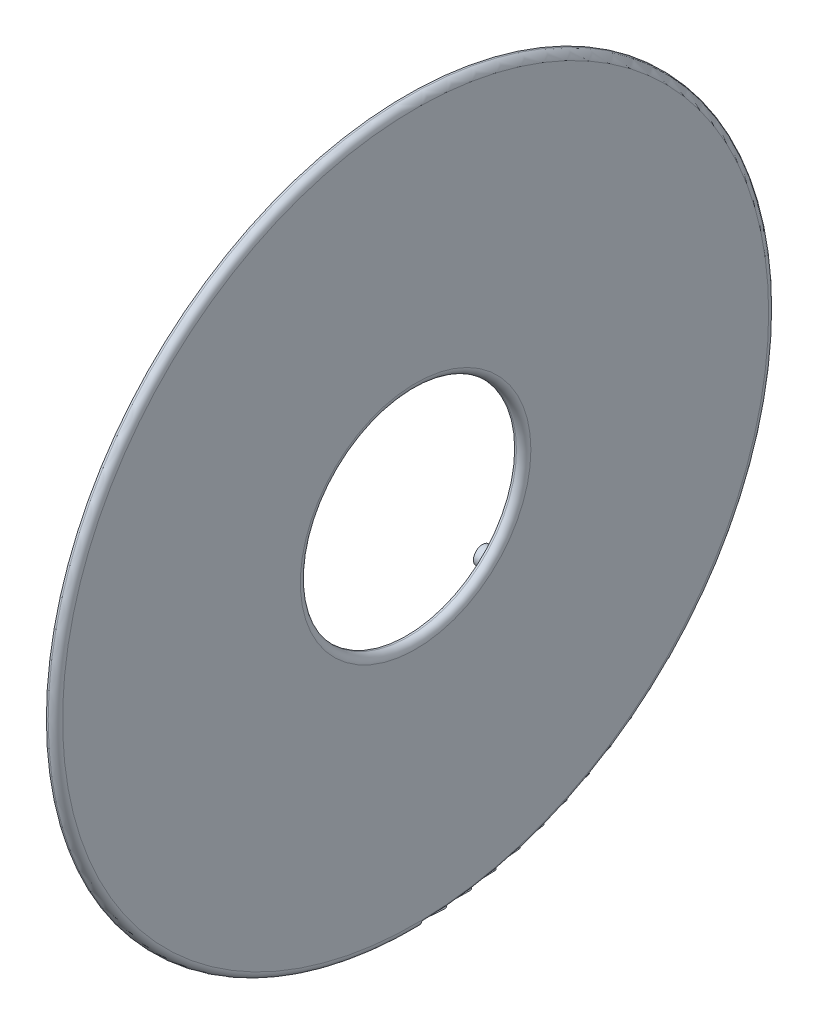
ISO-10303-21;
HEADER;
FILE_DESCRIPTION(('STEP AP214'),'2;1');
FILE_NAME('part.step','',(''),(''),'','','');
FILE_SCHEMA(('AUTOMOTIVE_DESIGN { 1 0 10303 214 1 1 1 1 }'));
ENDSEC;
DATA;
#1=APPLICATION_CONTEXT('core data for automotive mechanical design processes');
#2=APPLICATION_PROTOCOL_DEFINITION('international standard','automotive_design',2000,#1);
#3=PRODUCT_CONTEXT('',#1,'mechanical');
#4=PRODUCT('Part','Part','',(#3));
#5=PRODUCT_RELATED_PRODUCT_CATEGORY('part','',(#4));
#6=PRODUCT_DEFINITION_FORMATION('','',#4);
#7=PRODUCT_DEFINITION_CONTEXT('part definition',#1,'design');
#8=PRODUCT_DEFINITION('design','',#6,#7);
#9=PRODUCT_DEFINITION_SHAPE('','',#8);
#10=(LENGTH_UNIT() NAMED_UNIT(*) SI_UNIT(.MILLI.,.METRE.));
#11=(NAMED_UNIT(*) PLANE_ANGLE_UNIT() SI_UNIT($,.RADIAN.));
#12=(NAMED_UNIT(*) SI_UNIT($,.STERADIAN.) SOLID_ANGLE_UNIT());
#13=UNCERTAINTY_MEASURE_WITH_UNIT(LENGTH_MEASURE(1.E-05),#10,'distance_accuracy_value','');
#14=(GEOMETRIC_REPRESENTATION_CONTEXT(3) GLOBAL_UNCERTAINTY_ASSIGNED_CONTEXT((#13)) GLOBAL_UNIT_ASSIGNED_CONTEXT((#10,
#11,#12)) REPRESENTATION_CONTEXT('',''));
#15=CARTESIAN_POINT('',(0.,0.,0.));
#16=DIRECTION('',(0.,0.,1.));
#17=DIRECTION('',(1.,0.,0.));
#18=AXIS2_PLACEMENT_3D('',#15,#16,#17);
#19=CARTESIAN_POINT('',(0.,0.,0.));
#20=DIRECTION('',(1.,0.,0.));
#21=DIRECTION('',(0.,0.,-1.));
#22=AXIS2_PLACEMENT_3D('',#19,#20,#21);
#23=PLANE('',#22);
#24=CARTESIAN_POINT('',(0.,-7.63321770290865,7.63321770290874));
#25=DIRECTION('',(1.,0.,0.));
#26=DIRECTION('',(0.,0.,-1.));
#27=AXIS2_PLACEMENT_3D('',#24,#25,#26);
#28=CIRCLE('',#27,0.635000000000002);
#29=CARTESIAN_POINT('',(0.,-7.63321770290865,6.99821770290874));
#30=VERTEX_POINT('',#29);
#31=EDGE_CURVE('E39',#30,#30,#28,.F.);
#32=ORIENTED_EDGE('',*,*,#31,.F.);
#33=EDGE_LOOP('',(#32));
#34=FACE_BOUND('',#33,.T.);
#35=CARTESIAN_POINT('',(0.,7.63321770290882,-7.63321770290874));
#36=DIRECTION('',(1.,0.,0.));
#37=DIRECTION('',(0.,0.,-1.));
#38=AXIS2_PLACEMENT_3D('',#35,#36,#37);
#39=CIRCLE('',#38,0.634999999999951);
#40=CARTESIAN_POINT('',(0.,7.63321770290882,-8.26821770290869));
#41=VERTEX_POINT('',#40);
#42=EDGE_CURVE('E47',#41,#41,#39,.F.);
#43=ORIENTED_EDGE('',*,*,#42,.F.);
#44=EDGE_LOOP('',(#43));
#45=FACE_BOUND('',#44,.T.);
#46=CARTESIAN_POINT('',(0.,0.,0.));
#47=DIRECTION('',(1.,0.,0.));
#48=DIRECTION('',(0.,0.,-1.));
#49=AXIS2_PLACEMENT_3D('',#46,#47,#48);
#50=CIRCLE('',#49,25.4);
#51=CARTESIAN_POINT('',(0.,0.,-25.4));
#52=VERTEX_POINT('',#51);
#53=EDGE_CURVE('E64',#52,#52,#50,.T.);
#54=ORIENTED_EDGE('',*,*,#53,.F.);
#55=EDGE_LOOP('',(#54));
#56=FACE_BOUND('',#55,.T.);
#57=CARTESIAN_POINT('',(0.,0.,0.));
#58=DIRECTION('',(1.,0.,0.));
#59=DIRECTION('',(0.,0.,-1.));
#60=AXIS2_PLACEMENT_3D('',#57,#58,#59);
#61=CIRCLE('',#60,7.62);
#62=CARTESIAN_POINT('',(0.,0.,-7.62));
#63=VERTEX_POINT('',#62);
#64=EDGE_CURVE('E67',#63,#63,#61,.T.);
#65=ORIENTED_EDGE('',*,*,#64,.T.);
#66=EDGE_LOOP('',(#65));
#67=FACE_BOUND('',#66,.T.);
#68=CARTESIAN_POINT('',(0.,7.63321770290882,7.63321770290874));
#69=DIRECTION('',(1.,0.,0.));
#70=DIRECTION('',(0.,0.,-1.));
#71=AXIS2_PLACEMENT_3D('',#68,#69,#70);
#72=CIRCLE('',#71,0.635000000000001);
#73=CARTESIAN_POINT('',(0.,7.63321770290882,6.99821770290874));
#74=VERTEX_POINT('',#73);
#75=EDGE_CURVE('E43',#74,#74,#72,.F.);
#76=ORIENTED_EDGE('',*,*,#75,.F.);
#77=EDGE_LOOP('',(#76));
#78=FACE_BOUND('',#77,.T.);
#79=CARTESIAN_POINT('',(0.,-7.63321770290865,-7.63321770290874));
#80=DIRECTION('',(1.,0.,0.));
#81=DIRECTION('',(0.,0.,-1.));
#82=AXIS2_PLACEMENT_3D('',#79,#80,#81);
#83=CIRCLE('',#82,0.635000000000001);
#84=CARTESIAN_POINT('',(0.,-7.63321770290865,-8.26821770290874));
#85=VERTEX_POINT('',#84);
#86=EDGE_CURVE('E10',#85,#85,#83,.F.);
#87=ORIENTED_EDGE('',*,*,#86,.F.);
#88=EDGE_LOOP('',(#87));
#89=FACE_BOUND('',#88,.T.);
#90=ADVANCED_FACE('F32',(#34,#45,#56,#67,#78,#89),#23,.F.);
#91=CARTESIAN_POINT('',(0.635,0.,0.));
#92=DIRECTION('',(1.,0.,0.));
#93=DIRECTION('',(0.,0.,-1.));
#94=AXIS2_PLACEMENT_3D('',#91,#92,#93);
#95=PLANE('',#94);
#96=CARTESIAN_POINT('',(0.635,0.,0.));
#97=DIRECTION('',(1.,0.,0.));
#98=DIRECTION('',(0.,0.,-1.));
#99=AXIS2_PLACEMENT_3D('',#96,#97,#98);
#100=CIRCLE('',#99,8.128);
#101=CARTESIAN_POINT('',(0.635,0.,-8.128));
#102=VERTEX_POINT('',#101);
#103=EDGE_CURVE('E55',#102,#102,#100,.F.);
#104=ORIENTED_EDGE('',*,*,#103,.T.);
#105=EDGE_LOOP('',(#104));
#106=FACE_BOUND('',#105,.T.);
#107=CARTESIAN_POINT('',(0.635,0.,0.));
#108=DIRECTION('',(1.,0.,0.));
#109=DIRECTION('',(0.,0.,-1.));
#110=AXIS2_PLACEMENT_3D('',#107,#108,#109);
#111=CIRCLE('',#110,24.892);
#112=CARTESIAN_POINT('',(0.635,0.,-24.892));
#113=VERTEX_POINT('',#112);
#114=EDGE_CURVE('E58',#113,#113,#111,.T.);
#115=ORIENTED_EDGE('',*,*,#114,.T.);
#116=EDGE_LOOP('',(#115));
#117=FACE_BOUND('',#116,.T.);
#118=ADVANCED_FACE('F98',(#106,#117),#95,.T.);
#119=CARTESIAN_POINT('',(0.635,0.,0.));
#120=DIRECTION('',(-1.,0.,0.));
#121=DIRECTION('',(0.,0.,1.));
#122=AXIS2_PLACEMENT_3D('',#119,#120,#121);
#123=CYLINDRICAL_SURFACE('',#122,25.4);
#124=CARTESIAN_POINT('',(0.127,0.,0.));
#125=DIRECTION('',(1.,0.,0.));
#126=DIRECTION('',(0.,0.,-1.));
#127=AXIS2_PLACEMENT_3D('',#124,#125,#126);
#128=CIRCLE('',#127,25.4);
#129=CARTESIAN_POINT('',(0.127,0.,-25.4));
#130=VERTEX_POINT('',#129);
#131=EDGE_CURVE('E52',#130,#130,#128,.F.);
#132=ORIENTED_EDGE('',*,*,#131,.T.);
#133=EDGE_LOOP('',(#132));
#134=FACE_BOUND('',#133,.T.);
#135=ORIENTED_EDGE('',*,*,#53,.T.);
#136=EDGE_LOOP('',(#135));
#137=FACE_BOUND('',#136,.T.);
#138=ADVANCED_FACE('F104',(#134,#137),#123,.T.);
#139=CARTESIAN_POINT('',(0.635,0.,0.));
#140=DIRECTION('',(-1.,0.,0.));
#141=DIRECTION('',(0.,0.,1.));
#142=AXIS2_PLACEMENT_3D('',#139,#140,#141);
#143=CYLINDRICAL_SURFACE('',#142,7.62);
#144=CARTESIAN_POINT('',(0.127,0.,0.));
#145=DIRECTION('',(1.,0.,0.));
#146=DIRECTION('',(0.,0.,-1.));
#147=AXIS2_PLACEMENT_3D('',#144,#145,#146);
#148=CIRCLE('',#147,7.62);
#149=CARTESIAN_POINT('',(0.127,0.,-7.62));
#150=VERTEX_POINT('',#149);
#151=EDGE_CURVE('E61',#150,#150,#148,.T.);
#152=ORIENTED_EDGE('',*,*,#151,.T.);
#153=EDGE_LOOP('',(#152));
#154=FACE_BOUND('',#153,.T.);
#155=ORIENTED_EDGE('',*,*,#64,.F.);
#156=EDGE_LOOP('',(#155));
#157=FACE_BOUND('',#156,.T.);
#158=ADVANCED_FACE('F111',(#154,#157),#143,.F.);
#159=CARTESIAN_POINT('',(0.127,0.,0.));
#160=DIRECTION('',(1.,0.,0.));
#161=DIRECTION('',(0.,0.,-1.));
#162=AXIS2_PLACEMENT_3D('',#159,#160,#161);
#163=TOROIDAL_SURFACE('',#162,8.128,0.508);
#164=ORIENTED_EDGE('',*,*,#103,.F.);
#165=EDGE_LOOP('',(#164));
#166=FACE_BOUND('',#165,.T.);
#167=ORIENTED_EDGE('',*,*,#151,.F.);
#168=EDGE_LOOP('',(#167));
#169=FACE_BOUND('',#168,.T.);
#170=ADVANCED_FACE('F113',(#166,#169),#163,.T.);
#171=CARTESIAN_POINT('',(0.127,0.,0.));
#172=DIRECTION('',(1.,0.,0.));
#173=DIRECTION('',(0.,0.,-1.));
#174=AXIS2_PLACEMENT_3D('',#171,#172,#173);
#175=TOROIDAL_SURFACE('',#174,24.892,0.508);
#176=ORIENTED_EDGE('',*,*,#131,.F.);
#177=EDGE_LOOP('',(#176));
#178=FACE_BOUND('',#177,.T.);
#179=ORIENTED_EDGE('',*,*,#114,.F.);
#180=EDGE_LOOP('',(#179));
#181=FACE_BOUND('',#180,.T.);
#182=ADVANCED_FACE('F34',(#178,#181),#175,.T.);
#183=CARTESIAN_POINT('',(-2.286,7.63321770290882,-7.63321770290874));
#184=DIRECTION('',(1.,0.,0.));
#185=DIRECTION('',(0.,0.,-1.));
#186=AXIS2_PLACEMENT_3D('',#183,#184,#185);
#187=CYLINDRICAL_SURFACE('',#186,0.634999999999951);
#188=CARTESIAN_POINT('',(-2.286,7.63321770290882,-7.63321770290874));
#189=DIRECTION('',(-1.,0.,0.));
#190=DIRECTION('',(0.,0.,1.));
#191=AXIS2_PLACEMENT_3D('',#188,#189,#190);
#192=CIRCLE('',#191,0.634999999999951);
#193=CARTESIAN_POINT('',(-2.286,7.63321770290882,-6.99821770290879));
#194=VERTEX_POINT('',#193);
#195=EDGE_CURVE('E70',#194,#194,#192,.T.);
#196=ORIENTED_EDGE('',*,*,#195,.F.);
#197=EDGE_LOOP('',(#196));
#198=FACE_BOUND('',#197,.T.);
#199=ORIENTED_EDGE('',*,*,#42,.T.);
#200=EDGE_LOOP('',(#199));
#201=FACE_BOUND('',#200,.T.);
#202=ADVANCED_FACE('F120',(#198,#201),#187,.T.);
#203=CARTESIAN_POINT('',(-2.286,7.63321770290882,-7.63321770290874));
#204=DIRECTION('',(-1.,0.,0.));
#205=DIRECTION('',(0.,0.,1.));
#206=AXIS2_PLACEMENT_3D('',#203,#204,#205);
#207=PLANE('',#206);
#208=ORIENTED_EDGE('',*,*,#195,.T.);
#209=EDGE_LOOP('',(#208));
#210=FACE_BOUND('',#209,.T.);
#211=ADVANCED_FACE('F136',(#210),#207,.T.);
#212=CARTESIAN_POINT('',(-2.286,7.63321770290882,7.63321770290874));
#213=DIRECTION('',(1.,0.,0.));
#214=DIRECTION('',(0.,0.,-1.));
#215=AXIS2_PLACEMENT_3D('',#212,#213,#214);
#216=CYLINDRICAL_SURFACE('',#215,0.635000000000001);
#217=CARTESIAN_POINT('',(-2.286,7.63321770290882,7.63321770290874));
#218=DIRECTION('',(-1.,0.,0.));
#219=DIRECTION('',(0.,0.,1.));
#220=AXIS2_PLACEMENT_3D('',#217,#218,#219);
#221=CIRCLE('',#220,0.635000000000001);
#222=CARTESIAN_POINT('',(-2.286,7.63321770290882,8.26821770290874));
#223=VERTEX_POINT('',#222);
#224=EDGE_CURVE('E73',#223,#223,#221,.T.);
#225=ORIENTED_EDGE('',*,*,#224,.F.);
#226=EDGE_LOOP('',(#225));
#227=FACE_BOUND('',#226,.T.);
#228=ORIENTED_EDGE('',*,*,#75,.T.);
#229=EDGE_LOOP('',(#228));
#230=FACE_BOUND('',#229,.T.);
#231=ADVANCED_FACE('F133',(#227,#230),#216,.T.);
#232=CARTESIAN_POINT('',(-2.286,7.63321770290882,7.63321770290874));
#233=DIRECTION('',(-1.,0.,0.));
#234=DIRECTION('',(0.,0.,1.));
#235=AXIS2_PLACEMENT_3D('',#232,#233,#234);
#236=PLANE('',#235);
#237=ORIENTED_EDGE('',*,*,#224,.T.);
#238=EDGE_LOOP('',(#237));
#239=FACE_BOUND('',#238,.T.);
#240=ADVANCED_FACE('F135',(#239),#236,.T.);
#241=CARTESIAN_POINT('',(-2.286,-7.63321770290865,7.63321770290874));
#242=DIRECTION('',(1.,0.,0.));
#243=DIRECTION('',(0.,0.,-1.));
#244=AXIS2_PLACEMENT_3D('',#241,#242,#243);
#245=CYLINDRICAL_SURFACE('',#244,0.635000000000002);
#246=CARTESIAN_POINT('',(-2.286,-7.63321770290865,7.63321770290874));
#247=DIRECTION('',(-1.,0.,0.));
#248=DIRECTION('',(0.,0.,1.));
#249=AXIS2_PLACEMENT_3D('',#246,#247,#248);
#250=CIRCLE('',#249,0.635000000000002);
#251=CARTESIAN_POINT('',(-2.286,-7.63321770290865,8.26821770290874));
#252=VERTEX_POINT('',#251);
#253=EDGE_CURVE('E76',#252,#252,#250,.T.);
#254=ORIENTED_EDGE('',*,*,#253,.F.);
#255=EDGE_LOOP('',(#254));
#256=FACE_BOUND('',#255,.T.);
#257=ORIENTED_EDGE('',*,*,#31,.T.);
#258=EDGE_LOOP('',(#257));
#259=FACE_BOUND('',#258,.T.);
#260=ADVANCED_FACE('F94',(#256,#259),#245,.T.);
#261=CARTESIAN_POINT('',(-2.286,-7.63321770290865,7.63321770290874));
#262=DIRECTION('',(-1.,0.,0.));
#263=DIRECTION('',(0.,0.,1.));
#264=AXIS2_PLACEMENT_3D('',#261,#262,#263);
#265=PLANE('',#264);
#266=ORIENTED_EDGE('',*,*,#253,.T.);
#267=EDGE_LOOP('',(#266));
#268=FACE_BOUND('',#267,.T.);
#269=ADVANCED_FACE('F87',(#268),#265,.T.);
#270=CARTESIAN_POINT('',(-2.286,-7.63321770290865,-7.63321770290874));
#271=DIRECTION('',(1.,0.,0.));
#272=DIRECTION('',(0.,0.,-1.));
#273=AXIS2_PLACEMENT_3D('',#270,#271,#272);
#274=CYLINDRICAL_SURFACE('',#273,0.635000000000001);
#275=CARTESIAN_POINT('',(-2.286,-7.63321770290865,-7.63321770290874));
#276=DIRECTION('',(-1.,0.,0.));
#277=DIRECTION('',(0.,0.,1.));
#278=AXIS2_PLACEMENT_3D('',#275,#276,#277);
#279=CIRCLE('',#278,0.635000000000001);
#280=CARTESIAN_POINT('',(-2.286,-7.63321770290865,-6.99821770290874));
#281=VERTEX_POINT('',#280);
#282=EDGE_CURVE('E79',#281,#281,#279,.T.);
#283=ORIENTED_EDGE('',*,*,#282,.F.);
#284=EDGE_LOOP('',(#283));
#285=FACE_BOUND('',#284,.T.);
#286=ORIENTED_EDGE('',*,*,#86,.T.);
#287=EDGE_LOOP('',(#286));
#288=FACE_BOUND('',#287,.T.);
#289=ADVANCED_FACE('F85',(#285,#288),#274,.T.);
#290=CARTESIAN_POINT('',(-2.286,-7.63321770290865,-7.63321770290874));
#291=DIRECTION('',(-1.,0.,0.));
#292=DIRECTION('',(0.,0.,1.));
#293=AXIS2_PLACEMENT_3D('',#290,#291,#292);
#294=PLANE('',#293);
#295=ORIENTED_EDGE('',*,*,#282,.T.);
#296=EDGE_LOOP('',(#295));
#297=FACE_BOUND('',#296,.T.);
#298=ADVANCED_FACE('F83',(#297),#294,.T.);
#299=CLOSED_SHELL('',(#90,#118,#138,#158,#170,#182,#202,#211,#231,#240,#260,#269,#289,#298));
#300=MANIFOLD_SOLID_BREP('B2',#299);
#301=ADVANCED_BREP_SHAPE_REPRESENTATION('',(#18,#300),#14);
#302=SHAPE_DEFINITION_REPRESENTATION(#9,#301);
ENDSEC;
END-ISO-10303-21;
